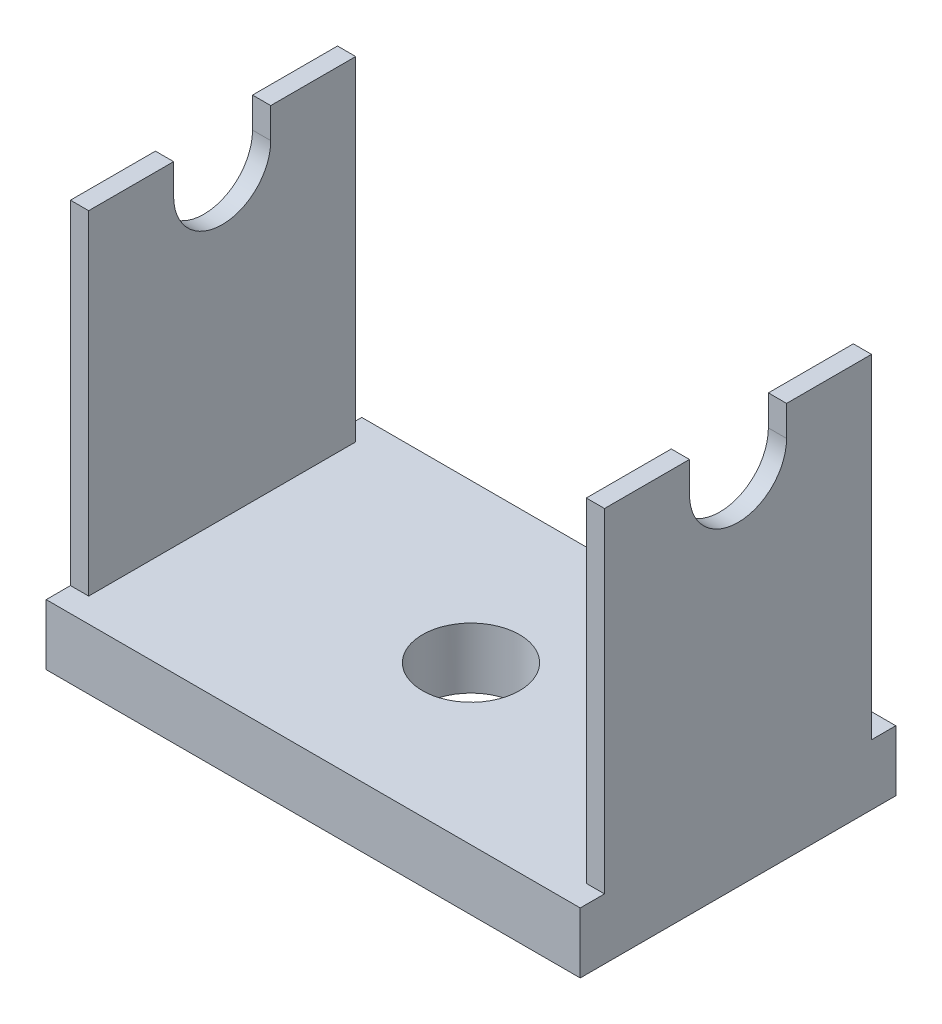
ISO-10303-21;
HEADER;
FILE_DESCRIPTION(('STEP AP214'),'2;1');
FILE_NAME('part.step','',(''),(''),'','','');
FILE_SCHEMA(('AUTOMOTIVE_DESIGN { 1 0 10303 214 1 1 1 1 }'));
ENDSEC;
DATA;
#1=APPLICATION_CONTEXT('core data for automotive mechanical design processes');
#2=APPLICATION_PROTOCOL_DEFINITION('international standard','automotive_design',2000,#1);
#3=PRODUCT_CONTEXT('',#1,'mechanical');
#4=PRODUCT('Part','Part','',(#3));
#5=PRODUCT_RELATED_PRODUCT_CATEGORY('part','',(#4));
#6=PRODUCT_DEFINITION_FORMATION('','',#4);
#7=PRODUCT_DEFINITION_CONTEXT('part definition',#1,'design');
#8=PRODUCT_DEFINITION('design','',#6,#7);
#9=PRODUCT_DEFINITION_SHAPE('','',#8);
#10=(LENGTH_UNIT() NAMED_UNIT(*) SI_UNIT(.MILLI.,.METRE.));
#11=(NAMED_UNIT(*) PLANE_ANGLE_UNIT() SI_UNIT($,.RADIAN.));
#12=(NAMED_UNIT(*) SI_UNIT($,.STERADIAN.) SOLID_ANGLE_UNIT());
#13=UNCERTAINTY_MEASURE_WITH_UNIT(LENGTH_MEASURE(1.E-05),#10,'distance_accuracy_value','');
#14=(GEOMETRIC_REPRESENTATION_CONTEXT(3) GLOBAL_UNCERTAINTY_ASSIGNED_CONTEXT((#13)) GLOBAL_UNIT_ASSIGNED_CONTEXT((#10,
#11,#12)) REPRESENTATION_CONTEXT('',''));
#15=CARTESIAN_POINT('',(0.,0.,0.));
#16=DIRECTION('',(0.,0.,1.));
#17=DIRECTION('',(1.,0.,0.));
#18=AXIS2_PLACEMENT_3D('',#15,#16,#17);
#19=CARTESIAN_POINT('',(-22.,2.5,-11.));
#20=DIRECTION('',(0.,0.,1.));
#21=DIRECTION('',(1.,0.,0.));
#22=AXIS2_PLACEMENT_3D('',#19,#20,#21);
#23=PLANE('',#22);
#24=DIRECTION('',(1.,0.,0.));
#25=VECTOR('',#24,1.);
#26=CARTESIAN_POINT('',(-22.,-25.,-11.));
#27=LINE('',#26,#25);
#28=CARTESIAN_POINT('',(-22.,-25.,-11.));
#29=VERTEX_POINT('',#28);
#30=CARTESIAN_POINT('',(-20.5,-25.,-11.));
#31=VERTEX_POINT('',#30);
#32=EDGE_CURVE('E215',#29,#31,#27,.T.);
#33=ORIENTED_EDGE('',*,*,#32,.F.);
#34=DIRECTION('',(0.,-1.,0.));
#35=VECTOR('',#34,1.);
#36=CARTESIAN_POINT('',(-22.,2.5,-11.));
#37=LINE('',#36,#35);
#38=CARTESIAN_POINT('',(-22.,2.5,-11.));
#39=VERTEX_POINT('',#38);
#40=EDGE_CURVE('E259',#39,#29,#37,.T.);
#41=ORIENTED_EDGE('',*,*,#40,.F.);
#42=DIRECTION('',(-1.,0.,0.));
#43=VECTOR('',#42,1.);
#44=CARTESIAN_POINT('',(-20.5,2.5,-11.));
#45=LINE('',#44,#43);
#46=CARTESIAN_POINT('',(-20.5,2.5,-11.));
#47=VERTEX_POINT('',#46);
#48=EDGE_CURVE('E256',#47,#39,#45,.T.);
#49=ORIENTED_EDGE('',*,*,#48,.F.);
#50=DIRECTION('',(0.,1.,0.));
#51=VECTOR('',#50,1.);
#52=CARTESIAN_POINT('',(-20.5,-28.5,-11.));
#53=LINE('',#52,#51);
#54=EDGE_CURVE('E270',#31,#47,#53,.T.);
#55=ORIENTED_EDGE('',*,*,#54,.F.);
#56=EDGE_LOOP('',(#33,#41,#49,#55));
#57=FACE_BOUND('',#56,.T.);
#58=ADVANCED_FACE('F33',(#57),#23,.F.);
#59=CARTESIAN_POINT('',(-22.,2.5,11.));
#60=DIRECTION('',(0.,0.,1.));
#61=DIRECTION('',(1.,0.,0.));
#62=AXIS2_PLACEMENT_3D('',#59,#60,#61);
#63=PLANE('',#62);
#64=DIRECTION('',(0.,-1.,0.));
#65=VECTOR('',#64,1.);
#66=CARTESIAN_POINT('',(-22.,2.5,11.));
#67=LINE('',#66,#65);
#68=CARTESIAN_POINT('',(-22.,2.5,11.));
#69=VERTEX_POINT('',#68);
#70=CARTESIAN_POINT('',(-22.,-25.,11.));
#71=VERTEX_POINT('',#70);
#72=EDGE_CURVE('E275',#69,#71,#67,.T.);
#73=ORIENTED_EDGE('',*,*,#72,.T.);
#74=DIRECTION('',(1.,0.,0.));
#75=VECTOR('',#74,1.);
#76=CARTESIAN_POINT('',(-22.,-25.,11.));
#77=LINE('',#76,#75);
#78=CARTESIAN_POINT('',(-20.5,-25.,11.));
#79=VERTEX_POINT('',#78);
#80=EDGE_CURVE('E58',#71,#79,#77,.T.);
#81=ORIENTED_EDGE('',*,*,#80,.T.);
#82=DIRECTION('',(0.,1.,0.));
#83=VECTOR('',#82,1.);
#84=CARTESIAN_POINT('',(-20.5,-28.5,11.));
#85=LINE('',#84,#83);
#86=CARTESIAN_POINT('',(-20.5,2.5,11.));
#87=VERTEX_POINT('',#86);
#88=EDGE_CURVE('E260',#79,#87,#85,.T.);
#89=ORIENTED_EDGE('',*,*,#88,.T.);
#90=DIRECTION('',(-1.,0.,0.));
#91=VECTOR('',#90,1.);
#92=CARTESIAN_POINT('',(-20.5,2.5,11.));
#93=LINE('',#92,#91);
#94=EDGE_CURVE('E255',#87,#69,#93,.T.);
#95=ORIENTED_EDGE('',*,*,#94,.T.);
#96=EDGE_LOOP('',(#73,#81,#89,#95));
#97=FACE_BOUND('',#96,.T.);
#98=ADVANCED_FACE('F402',(#97),#63,.T.);
#99=CARTESIAN_POINT('',(-20.5,-28.5,-11.));
#100=DIRECTION('',(1.,0.,0.));
#101=DIRECTION('',(0.,0.,-1.));
#102=AXIS2_PLACEMENT_3D('',#99,#100,#101);
#103=PLANE('',#102);
#104=ORIENTED_EDGE('',*,*,#88,.F.);
#105=DIRECTION('',(0.,0.,-1.));
#106=VECTOR('',#105,1.);
#107=CARTESIAN_POINT('',(-20.5,-25.,-11.));
#108=LINE('',#107,#106);
#109=EDGE_CURVE('E50',#79,#31,#108,.T.);
#110=ORIENTED_EDGE('',*,*,#109,.T.);
#111=ORIENTED_EDGE('',*,*,#54,.T.);
#112=DIRECTION('',(0.,0.,1.));
#113=VECTOR('',#112,1.);
#114=CARTESIAN_POINT('',(-20.5,2.5,-11.));
#115=LINE('',#114,#113);
#116=CARTESIAN_POINT('',(-20.5,2.5,-4.));
#117=VERTEX_POINT('',#116);
#118=EDGE_CURVE('E286',#47,#117,#115,.T.);
#119=ORIENTED_EDGE('',*,*,#118,.T.);
#120=DIRECTION('',(0.,1.,0.));
#121=VECTOR('',#120,1.);
#122=CARTESIAN_POINT('',(-20.5,-28.5,-4.));
#123=LINE('',#122,#121);
#124=CARTESIAN_POINT('',(-20.5,0.,-4.));
#125=VERTEX_POINT('',#124);
#126=EDGE_CURVE('E241',#125,#117,#123,.T.);
#127=ORIENTED_EDGE('',*,*,#126,.F.);
#128=CARTESIAN_POINT('',(-20.5,0.,0.));
#129=DIRECTION('',(1.,0.,0.));
#130=DIRECTION('',(0.,0.,-1.));
#131=AXIS2_PLACEMENT_3D('',#128,#129,#130);
#132=CIRCLE('',#131,4.);
#133=CARTESIAN_POINT('',(-20.5,0.,4.));
#134=VERTEX_POINT('',#133);
#135=EDGE_CURVE('E249',#134,#125,#132,.T.);
#136=ORIENTED_EDGE('',*,*,#135,.F.);
#137=DIRECTION('',(0.,-1.,0.));
#138=VECTOR('',#137,1.);
#139=CARTESIAN_POINT('',(-20.5,-28.5,4.));
#140=LINE('',#139,#138);
#141=CARTESIAN_POINT('',(-20.5,2.5,4.));
#142=VERTEX_POINT('',#141);
#143=EDGE_CURVE('E245',#142,#134,#140,.T.);
#144=ORIENTED_EDGE('',*,*,#143,.F.);
#145=EDGE_CURVE('E290',#142,#87,#115,.T.);
#146=ORIENTED_EDGE('',*,*,#145,.T.);
#147=EDGE_LOOP('',(#104,#110,#111,#119,#127,#136,#144,#146));
#148=FACE_BOUND('',#147,.T.);
#149=ADVANCED_FACE('F323',(#148),#103,.T.);
#150=CARTESIAN_POINT('',(20.5,2.50000000000001,-11.));
#151=DIRECTION('',(-1.,0.,0.));
#152=DIRECTION('',(0.,-1.,0.));
#153=AXIS2_PLACEMENT_3D('',#150,#151,#152);
#154=PLANE('',#153);
#155=DIRECTION('',(0.,-1.,0.));
#156=VECTOR('',#155,1.);
#157=CARTESIAN_POINT('',(20.5,2.50000000000001,-11.));
#158=LINE('',#157,#156);
#159=CARTESIAN_POINT('',(20.5,2.50000000000001,-11.));
#160=VERTEX_POINT('',#159);
#161=CARTESIAN_POINT('',(20.5,-25.,-11.));
#162=VERTEX_POINT('',#161);
#163=EDGE_CURVE('E267',#160,#162,#158,.T.);
#164=ORIENTED_EDGE('',*,*,#163,.T.);
#165=DIRECTION('',(0.,0.,1.));
#166=VECTOR('',#165,1.);
#167=CARTESIAN_POINT('',(20.5,-25.,-10.9999999999999));
#168=LINE('',#167,#166);
#169=CARTESIAN_POINT('',(20.5,-25.,11.));
#170=VERTEX_POINT('',#169);
#171=EDGE_CURVE('E208',#162,#170,#168,.T.);
#172=ORIENTED_EDGE('',*,*,#171,.T.);
#173=DIRECTION('',(0.,-1.,0.));
#174=VECTOR('',#173,1.);
#175=CARTESIAN_POINT('',(20.5,2.50000000000001,11.));
#176=LINE('',#175,#174);
#177=CARTESIAN_POINT('',(20.5,2.50000000000001,11.));
#178=VERTEX_POINT('',#177);
#179=EDGE_CURVE('E282',#178,#170,#176,.T.);
#180=ORIENTED_EDGE('',*,*,#179,.F.);
#181=DIRECTION('',(0.,0.,1.));
#182=VECTOR('',#181,1.);
#183=CARTESIAN_POINT('',(20.5,2.50000000000001,-11.));
#184=LINE('',#183,#182);
#185=CARTESIAN_POINT('',(20.5,2.50000000000001,4.));
#186=VERTEX_POINT('',#185);
#187=EDGE_CURVE('E294',#186,#178,#184,.T.);
#188=ORIENTED_EDGE('',*,*,#187,.F.);
#189=DIRECTION('',(0.,1.,0.));
#190=VECTOR('',#189,1.);
#191=CARTESIAN_POINT('',(20.5,2.50000000000001,4.));
#192=LINE('',#191,#190);
#193=CARTESIAN_POINT('',(20.5,0.,4.));
#194=VERTEX_POINT('',#193);
#195=EDGE_CURVE('E243',#194,#186,#192,.T.);
#196=ORIENTED_EDGE('',*,*,#195,.F.);
#197=CARTESIAN_POINT('',(20.5,0.,0.));
#198=DIRECTION('',(-1.,0.,0.));
#199=DIRECTION('',(0.,-1.,0.));
#200=AXIS2_PLACEMENT_3D('',#197,#198,#199);
#201=CIRCLE('',#200,4.);
#202=CARTESIAN_POINT('',(20.5,0.,-4.));
#203=VERTEX_POINT('',#202);
#204=EDGE_CURVE('E247',#203,#194,#201,.T.);
#205=ORIENTED_EDGE('',*,*,#204,.F.);
#206=DIRECTION('',(0.,-1.,0.));
#207=VECTOR('',#206,1.);
#208=CARTESIAN_POINT('',(20.5,2.50000000000001,-4.));
#209=LINE('',#208,#207);
#210=CARTESIAN_POINT('',(20.5,2.50000000000001,-4.));
#211=VERTEX_POINT('',#210);
#212=EDGE_CURVE('E239',#211,#203,#209,.T.);
#213=ORIENTED_EDGE('',*,*,#212,.F.);
#214=EDGE_CURVE('E291',#160,#211,#184,.T.);
#215=ORIENTED_EDGE('',*,*,#214,.F.);
#216=EDGE_LOOP('',(#164,#172,#180,#188,#196,#205,#213,#215));
#217=FACE_BOUND('',#216,.T.);
#218=ADVANCED_FACE('F366',(#217),#154,.T.);
#219=DIRECTION('',(1.,0.,0.));
#220=VECTOR('',#219,1.);
#221=CARTESIAN_POINT('',(-22.,-25.,-11.));
#222=LINE('',#221,#220);
#223=CARTESIAN_POINT('',(22.,-25.,-11.));
#224=VERTEX_POINT('',#223);
#225=EDGE_CURVE('E210',#162,#224,#222,.T.);
#226=ORIENTED_EDGE('',*,*,#225,.F.);
#227=ORIENTED_EDGE('',*,*,#163,.F.);
#228=DIRECTION('',(-1.,0.,0.));
#229=VECTOR('',#228,1.);
#230=CARTESIAN_POINT('',(22.,2.50000000000001,-11.));
#231=LINE('',#230,#229);
#232=CARTESIAN_POINT('',(22.,2.50000000000001,-11.));
#233=VERTEX_POINT('',#232);
#234=EDGE_CURVE('E264',#233,#160,#231,.T.);
#235=ORIENTED_EDGE('',*,*,#234,.F.);
#236=DIRECTION('',(0.,1.,0.));
#237=VECTOR('',#236,1.);
#238=CARTESIAN_POINT('',(22.,-30.,-11.));
#239=LINE('',#238,#237);
#240=EDGE_CURVE('E262',#224,#233,#239,.T.);
#241=ORIENTED_EDGE('',*,*,#240,.F.);
#242=EDGE_LOOP('',(#226,#227,#235,#241));
#243=FACE_BOUND('',#242,.T.);
#244=ADVANCED_FACE('F364',(#243),#23,.F.);
#245=ORIENTED_EDGE('',*,*,#179,.T.);
#246=DIRECTION('',(1.,0.,0.));
#247=VECTOR('',#246,1.);
#248=CARTESIAN_POINT('',(-22.,-25.,11.));
#249=LINE('',#248,#247);
#250=CARTESIAN_POINT('',(22.,-25.,11.));
#251=VERTEX_POINT('',#250);
#252=EDGE_CURVE('E206',#170,#251,#249,.T.);
#253=ORIENTED_EDGE('',*,*,#252,.T.);
#254=DIRECTION('',(0.,1.,0.));
#255=VECTOR('',#254,1.);
#256=CARTESIAN_POINT('',(22.,-30.,11.));
#257=LINE('',#256,#255);
#258=CARTESIAN_POINT('',(22.,2.50000000000001,11.));
#259=VERTEX_POINT('',#258);
#260=EDGE_CURVE('E277',#251,#259,#257,.T.);
#261=ORIENTED_EDGE('',*,*,#260,.T.);
#262=DIRECTION('',(-1.,0.,0.));
#263=VECTOR('',#262,1.);
#264=CARTESIAN_POINT('',(22.,2.50000000000001,11.));
#265=LINE('',#264,#263);
#266=EDGE_CURVE('E279',#259,#178,#265,.T.);
#267=ORIENTED_EDGE('',*,*,#266,.T.);
#268=EDGE_LOOP('',(#245,#253,#261,#267));
#269=FACE_BOUND('',#268,.T.);
#270=ADVANCED_FACE('F388',(#269),#63,.T.);
#271=CARTESIAN_POINT('',(-20.5,2.5,-11.));
#272=DIRECTION('',(0.,1.,0.));
#273=DIRECTION('',(0.,0.,1.));
#274=AXIS2_PLACEMENT_3D('',#271,#272,#273);
#275=PLANE('',#274);
#276=DIRECTION('',(1.,0.,0.));
#277=VECTOR('',#276,1.);
#278=CARTESIAN_POINT('',(-22.000025,2.5,4.));
#279=LINE('',#278,#277);
#280=CARTESIAN_POINT('',(-22.,2.5,4.));
#281=VERTEX_POINT('',#280);
#282=EDGE_CURVE('E229',#281,#142,#279,.T.);
#283=ORIENTED_EDGE('',*,*,#282,.F.);
#284=DIRECTION('',(0.,0.,1.));
#285=VECTOR('',#284,1.);
#286=CARTESIAN_POINT('',(-22.,2.5,-11.));
#287=LINE('',#286,#285);
#288=EDGE_CURVE('E272',#281,#69,#287,.T.);
#289=ORIENTED_EDGE('',*,*,#288,.T.);
#290=ORIENTED_EDGE('',*,*,#94,.F.);
#291=ORIENTED_EDGE('',*,*,#145,.F.);
#292=EDGE_LOOP('',(#283,#289,#290,#291));
#293=FACE_BOUND('',#292,.T.);
#294=ADVANCED_FACE('F320',(#293),#275,.T.);
#295=CARTESIAN_POINT('',(22.,2.50000000000001,-11.));
#296=DIRECTION('',(0.,1.,0.));
#297=DIRECTION('',(0.,0.,1.));
#298=AXIS2_PLACEMENT_3D('',#295,#296,#297);
#299=PLANE('',#298);
#300=CARTESIAN_POINT('',(22.,2.50000000000001,4.));
#301=VERTEX_POINT('',#300);
#302=EDGE_CURVE('E230',#186,#301,#279,.T.);
#303=ORIENTED_EDGE('',*,*,#302,.F.);
#304=ORIENTED_EDGE('',*,*,#187,.T.);
#305=ORIENTED_EDGE('',*,*,#266,.F.);
#306=DIRECTION('',(0.,0.,1.));
#307=VECTOR('',#306,1.);
#308=CARTESIAN_POINT('',(22.,2.50000000000001,-11.));
#309=LINE('',#308,#307);
#310=EDGE_CURVE('E298',#301,#259,#309,.T.);
#311=ORIENTED_EDGE('',*,*,#310,.F.);
#312=EDGE_LOOP('',(#303,#304,#305,#311));
#313=FACE_BOUND('',#312,.T.);
#314=ADVANCED_FACE('F385',(#313),#299,.T.);
#315=DIRECTION('',(1.,0.,0.));
#316=VECTOR('',#315,1.);
#317=CARTESIAN_POINT('',(-22.000025,2.5,-4.));
#318=LINE('',#317,#316);
#319=CARTESIAN_POINT('',(-22.,2.5,-4.));
#320=VERTEX_POINT('',#319);
#321=EDGE_CURVE('E232',#320,#117,#318,.T.);
#322=ORIENTED_EDGE('',*,*,#321,.T.);
#323=ORIENTED_EDGE('',*,*,#118,.F.);
#324=ORIENTED_EDGE('',*,*,#48,.T.);
#325=EDGE_CURVE('E183',#39,#320,#287,.T.);
#326=ORIENTED_EDGE('',*,*,#325,.T.);
#327=EDGE_LOOP('',(#322,#323,#324,#326));
#328=FACE_BOUND('',#327,.T.);
#329=ADVANCED_FACE('F35',(#328),#275,.T.);
#330=CARTESIAN_POINT('',(22.,2.50000000000001,-4.));
#331=VERTEX_POINT('',#330);
#332=EDGE_CURVE('E233',#211,#331,#318,.T.);
#333=ORIENTED_EDGE('',*,*,#332,.T.);
#334=EDGE_CURVE('E295',#233,#331,#309,.T.);
#335=ORIENTED_EDGE('',*,*,#334,.F.);
#336=ORIENTED_EDGE('',*,*,#234,.T.);
#337=ORIENTED_EDGE('',*,*,#214,.T.);
#338=EDGE_LOOP('',(#333,#335,#336,#337));
#339=FACE_BOUND('',#338,.T.);
#340=ADVANCED_FACE('F362',(#339),#299,.T.);
#341=CARTESIAN_POINT('',(22.,-30.,-11.));
#342=DIRECTION('',(1.,0.,0.));
#343=DIRECTION('',(0.,0.,-1.));
#344=AXIS2_PLACEMENT_3D('',#341,#342,#343);
#345=PLANE('',#344);
#346=DIRECTION('',(0.,0.,-1.));
#347=VECTOR('',#346,1.);
#348=CARTESIAN_POINT('',(22.,-25.,13.0000000000001));
#349=LINE('',#348,#347);
#350=CARTESIAN_POINT('',(22.,-25.,-13.));
#351=VERTEX_POINT('',#350);
#352=EDGE_CURVE('E343',#224,#351,#349,.T.);
#353=ORIENTED_EDGE('',*,*,#352,.F.);
#354=ORIENTED_EDGE('',*,*,#240,.T.);
#355=ORIENTED_EDGE('',*,*,#334,.T.);
#356=DIRECTION('',(0.,1.,0.));
#357=VECTOR('',#356,1.);
#358=CARTESIAN_POINT('',(22.,2.50000000000001,-4.));
#359=LINE('',#358,#357);
#360=CARTESIAN_POINT('',(22.,0.,-4.));
#361=VERTEX_POINT('',#360);
#362=EDGE_CURVE('E220',#361,#331,#359,.T.);
#363=ORIENTED_EDGE('',*,*,#362,.F.);
#364=CARTESIAN_POINT('',(22.,0.,0.));
#365=DIRECTION('',(1.,0.,0.));
#366=DIRECTION('',(0.,1.,0.));
#367=AXIS2_PLACEMENT_3D('',#364,#365,#366);
#368=CIRCLE('',#367,4.);
#369=CARTESIAN_POINT('',(22.,0.,4.));
#370=VERTEX_POINT('',#369);
#371=EDGE_CURVE('E218',#370,#361,#368,.T.);
#372=ORIENTED_EDGE('',*,*,#371,.F.);
#373=DIRECTION('',(0.,-1.,0.));
#374=VECTOR('',#373,1.);
#375=CARTESIAN_POINT('',(22.,0.,4.));
#376=LINE('',#375,#374);
#377=EDGE_CURVE('E222',#301,#370,#376,.T.);
#378=ORIENTED_EDGE('',*,*,#377,.F.);
#379=ORIENTED_EDGE('',*,*,#310,.T.);
#380=ORIENTED_EDGE('',*,*,#260,.F.);
#381=CARTESIAN_POINT('',(22.,-25.,13.));
#382=VERTEX_POINT('',#381);
#383=EDGE_CURVE('E339',#382,#251,#349,.T.);
#384=ORIENTED_EDGE('',*,*,#383,.F.);
#385=DIRECTION('',(0.,-1.,0.));
#386=VECTOR('',#385,1.);
#387=CARTESIAN_POINT('',(22.,26.1077293567225,13.));
#388=LINE('',#387,#386);
#389=CARTESIAN_POINT('',(22.,-30.,13.));
#390=VERTEX_POINT('',#389);
#391=EDGE_CURVE('E200',#382,#390,#388,.T.);
#392=ORIENTED_EDGE('',*,*,#391,.T.);
#393=DIRECTION('',(0.,0.,1.));
#394=VECTOR('',#393,1.);
#395=CARTESIAN_POINT('',(22.,-30.,-11.));
#396=LINE('',#395,#394);
#397=CARTESIAN_POINT('',(22.,-30.,-13.));
#398=VERTEX_POINT('',#397);
#399=EDGE_CURVE('E182',#398,#390,#396,.T.);
#400=ORIENTED_EDGE('',*,*,#399,.F.);
#401=DIRECTION('',(0.,-1.,0.));
#402=VECTOR('',#401,1.);
#403=CARTESIAN_POINT('',(22.,26.1077293567225,-13.));
#404=LINE('',#403,#402);
#405=EDGE_CURVE('E190',#351,#398,#404,.T.);
#406=ORIENTED_EDGE('',*,*,#405,.F.);
#407=EDGE_LOOP('',(#353,#354,#355,#363,#372,#378,#379,#380,#384,#392,#400,#406));
#408=FACE_BOUND('',#407,.T.);
#409=ADVANCED_FACE('F349',(#408),#345,.T.);
#410=CARTESIAN_POINT('',(-22.,-30.,-11.));
#411=DIRECTION('',(0.,-1.,0.));
#412=DIRECTION('',(1.,0.,0.));
#413=AXIS2_PLACEMENT_3D('',#410,#411,#412);
#414=PLANE('',#413);
#415=CARTESIAN_POINT('',(0.,-30.,0.));
#416=DIRECTION('',(0.,-1.,0.));
#417=DIRECTION('',(1.,0.,0.));
#418=AXIS2_PLACEMENT_3D('',#415,#416,#417);
#419=CIRCLE('',#418,4.);
#420=CARTESIAN_POINT('',(4.,-30.,0.));
#421=VERTEX_POINT('',#420);
#422=EDGE_CURVE('E198',#421,#421,#419,.T.);
#423=ORIENTED_EDGE('',*,*,#422,.F.);
#424=EDGE_LOOP('',(#423));
#425=FACE_BOUND('',#424,.T.);
#426=DIRECTION('',(-1.,0.,0.));
#427=VECTOR('',#426,1.);
#428=CARTESIAN_POINT('',(19.5,-30.,-13.));
#429=LINE('',#428,#427);
#430=CARTESIAN_POINT('',(-22.,-30.,-13.));
#431=VERTEX_POINT('',#430);
#432=EDGE_CURVE('E174',#398,#431,#429,.T.);
#433=ORIENTED_EDGE('',*,*,#432,.F.);
#434=ORIENTED_EDGE('',*,*,#399,.T.);
#435=DIRECTION('',(-1.,0.,0.));
#436=VECTOR('',#435,1.);
#437=CARTESIAN_POINT('',(19.5,-30.,13.));
#438=LINE('',#437,#436);
#439=CARTESIAN_POINT('',(-22.,-30.,13.));
#440=VERTEX_POINT('',#439);
#441=EDGE_CURVE('E177',#390,#440,#438,.T.);
#442=ORIENTED_EDGE('',*,*,#441,.T.);
#443=DIRECTION('',(0.,0.,1.));
#444=VECTOR('',#443,1.);
#445=CARTESIAN_POINT('',(-22.,-30.,-11.));
#446=LINE('',#445,#444);
#447=EDGE_CURVE('E171',#431,#440,#446,.T.);
#448=ORIENTED_EDGE('',*,*,#447,.F.);
#449=EDGE_LOOP('',(#433,#434,#442,#448));
#450=FACE_BOUND('',#449,.T.);
#451=ADVANCED_FACE('F173',(#425,#450),#414,.T.);
#452=CARTESIAN_POINT('',(-22.,2.5,-11.));
#453=DIRECTION('',(-1.,0.,0.));
#454=DIRECTION('',(0.,-1.,0.));
#455=AXIS2_PLACEMENT_3D('',#452,#453,#454);
#456=PLANE('',#455);
#457=ORIENTED_EDGE('',*,*,#447,.T.);
#458=DIRECTION('',(0.,-1.,0.));
#459=VECTOR('',#458,1.);
#460=CARTESIAN_POINT('',(-22.,26.1077293567225,13.));
#461=LINE('',#460,#459);
#462=CARTESIAN_POINT('',(-22.,-25.,13.));
#463=VERTEX_POINT('',#462);
#464=EDGE_CURVE('E342',#463,#440,#461,.T.);
#465=ORIENTED_EDGE('',*,*,#464,.F.);
#466=DIRECTION('',(0.,0.,1.));
#467=VECTOR('',#466,1.);
#468=CARTESIAN_POINT('',(-22.,-25.,13.0000000000001));
#469=LINE('',#468,#467);
#470=EDGE_CURVE('E336',#71,#463,#469,.T.);
#471=ORIENTED_EDGE('',*,*,#470,.F.);
#472=ORIENTED_EDGE('',*,*,#72,.F.);
#473=ORIENTED_EDGE('',*,*,#288,.F.);
#474=DIRECTION('',(0.,1.,0.));
#475=VECTOR('',#474,1.);
#476=CARTESIAN_POINT('',(-22.,2.5,4.));
#477=LINE('',#476,#475);
#478=CARTESIAN_POINT('',(-22.,0.,4.));
#479=VERTEX_POINT('',#478);
#480=EDGE_CURVE('E11',#479,#281,#477,.T.);
#481=ORIENTED_EDGE('',*,*,#480,.F.);
#482=CARTESIAN_POINT('',(-22.,0.,0.));
#483=DIRECTION('',(1.,0.,0.));
#484=DIRECTION('',(0.,1.,0.));
#485=AXIS2_PLACEMENT_3D('',#482,#483,#484);
#486=CIRCLE('',#485,4.);
#487=CARTESIAN_POINT('',(-22.,0.,-4.));
#488=VERTEX_POINT('',#487);
#489=EDGE_CURVE('E42',#488,#479,#486,.F.);
#490=ORIENTED_EDGE('',*,*,#489,.F.);
#491=DIRECTION('',(0.,-1.,0.));
#492=VECTOR('',#491,1.);
#493=CARTESIAN_POINT('',(-22.,2.5,-4.));
#494=LINE('',#493,#492);
#495=EDGE_CURVE('E289',#320,#488,#494,.T.);
#496=ORIENTED_EDGE('',*,*,#495,.F.);
#497=ORIENTED_EDGE('',*,*,#325,.F.);
#498=ORIENTED_EDGE('',*,*,#40,.T.);
#499=CARTESIAN_POINT('',(-22.,-25.0000000000001,-13.));
#500=VERTEX_POINT('',#499);
#501=EDGE_CURVE('E197',#500,#29,#469,.T.);
#502=ORIENTED_EDGE('',*,*,#501,.F.);
#503=DIRECTION('',(0.,-1.,0.));
#504=VECTOR('',#503,1.);
#505=CARTESIAN_POINT('',(-22.,26.1077293567225,-13.));
#506=LINE('',#505,#504);
#507=EDGE_CURVE('E188',#500,#431,#506,.T.);
#508=ORIENTED_EDGE('',*,*,#507,.T.);
#509=EDGE_LOOP('',(#457,#465,#471,#472,#473,#481,#490,#496,#497,#498,#502,#508));
#510=FACE_BOUND('',#509,.T.);
#511=ADVANCED_FACE('F194',(#510),#456,.T.);
#512=CARTESIAN_POINT('',(19.5,-25.,13.));
#513=DIRECTION('',(0.,-1.,0.));
#514=DIRECTION('',(0.,0.,-1.));
#515=AXIS2_PLACEMENT_3D('',#512,#513,#514);
#516=PLANE('',#515);
#517=CARTESIAN_POINT('',(0.,-25.,0.));
#518=DIRECTION('',(0.,-1.,0.));
#519=DIRECTION('',(0.,0.,-1.));
#520=AXIS2_PLACEMENT_3D('',#517,#518,#519);
#521=CIRCLE('',#520,4.);
#522=CARTESIAN_POINT('',(0.,-25.,-4.));
#523=VERTEX_POINT('',#522);
#524=EDGE_CURVE('E37',#523,#523,#521,.T.);
#525=ORIENTED_EDGE('',*,*,#524,.T.);
#526=EDGE_LOOP('',(#525));
#527=FACE_BOUND('',#526,.T.);
#528=DIRECTION('',(-1.,0.,0.));
#529=VECTOR('',#528,1.);
#530=CARTESIAN_POINT('',(19.5,-25.,13.));
#531=LINE('',#530,#529);
#532=EDGE_CURVE('E253',#382,#463,#531,.T.);
#533=ORIENTED_EDGE('',*,*,#532,.F.);
#534=ORIENTED_EDGE('',*,*,#383,.T.);
#535=ORIENTED_EDGE('',*,*,#252,.F.);
#536=ORIENTED_EDGE('',*,*,#171,.F.);
#537=ORIENTED_EDGE('',*,*,#225,.T.);
#538=ORIENTED_EDGE('',*,*,#352,.T.);
#539=DIRECTION('',(-1.,0.,0.));
#540=VECTOR('',#539,1.);
#541=CARTESIAN_POINT('',(19.5,-25.,-13.));
#542=LINE('',#541,#540);
#543=EDGE_CURVE('E191',#351,#500,#542,.T.);
#544=ORIENTED_EDGE('',*,*,#543,.T.);
#545=ORIENTED_EDGE('',*,*,#501,.T.);
#546=ORIENTED_EDGE('',*,*,#32,.T.);
#547=ORIENTED_EDGE('',*,*,#109,.F.);
#548=ORIENTED_EDGE('',*,*,#80,.F.);
#549=ORIENTED_EDGE('',*,*,#470,.T.);
#550=EDGE_LOOP('',(#533,#534,#535,#536,#537,#538,#544,#545,#546,#547,#548,#549));
#551=FACE_BOUND('',#550,.T.);
#552=ADVANCED_FACE('F334',(#527,#551),#516,.F.);
#553=CARTESIAN_POINT('',(19.5,-30.,13.));
#554=DIRECTION('',(0.,0.,-1.));
#555=DIRECTION('',(-1.,0.,0.));
#556=AXIS2_PLACEMENT_3D('',#553,#554,#555);
#557=PLANE('',#556);
#558=ORIENTED_EDGE('',*,*,#532,.T.);
#559=ORIENTED_EDGE('',*,*,#464,.T.);
#560=ORIENTED_EDGE('',*,*,#441,.F.);
#561=ORIENTED_EDGE('',*,*,#391,.F.);
#562=EDGE_LOOP('',(#558,#559,#560,#561));
#563=FACE_BOUND('',#562,.T.);
#564=ADVANCED_FACE('F353',(#563),#557,.F.);
#565=CARTESIAN_POINT('',(19.5,-30.,-13.));
#566=DIRECTION('',(0.,0.,-1.));
#567=DIRECTION('',(-1.,0.,0.));
#568=AXIS2_PLACEMENT_3D('',#565,#566,#567);
#569=PLANE('',#568);
#570=ORIENTED_EDGE('',*,*,#432,.T.);
#571=ORIENTED_EDGE('',*,*,#507,.F.);
#572=ORIENTED_EDGE('',*,*,#543,.F.);
#573=ORIENTED_EDGE('',*,*,#405,.T.);
#574=EDGE_LOOP('',(#570,#571,#572,#573));
#575=FACE_BOUND('',#574,.T.);
#576=ADVANCED_FACE('F187',(#575),#569,.T.);
#577=CARTESIAN_POINT('',(-22.000025,2.5,-4.));
#578=DIRECTION('',(0.,0.,-1.));
#579=DIRECTION('',(-1.,0.,0.));
#580=AXIS2_PLACEMENT_3D('',#577,#578,#579);
#581=PLANE('',#580);
#582=ORIENTED_EDGE('',*,*,#126,.T.);
#583=ORIENTED_EDGE('',*,*,#321,.F.);
#584=ORIENTED_EDGE('',*,*,#495,.T.);
#585=DIRECTION('',(1.,0.,0.));
#586=VECTOR('',#585,1.);
#587=CARTESIAN_POINT('',(-22.000025,0.,-4.));
#588=LINE('',#587,#586);
#589=EDGE_CURVE('E236',#488,#125,#588,.T.);
#590=ORIENTED_EDGE('',*,*,#589,.T.);
#591=EDGE_LOOP('',(#582,#583,#584,#590));
#592=FACE_BOUND('',#591,.T.);
#593=ADVANCED_FACE('F326',(#592),#581,.F.);
#594=CARTESIAN_POINT('',(-22.000025,0.,4.));
#595=DIRECTION('',(0.,0.,1.));
#596=DIRECTION('',(1.,0.,0.));
#597=AXIS2_PLACEMENT_3D('',#594,#595,#596);
#598=PLANE('',#597);
#599=ORIENTED_EDGE('',*,*,#143,.T.);
#600=DIRECTION('',(1.,0.,0.));
#601=VECTOR('',#600,1.);
#602=CARTESIAN_POINT('',(-22.000025,0.,4.));
#603=LINE('',#602,#601);
#604=EDGE_CURVE('E228',#479,#134,#603,.T.);
#605=ORIENTED_EDGE('',*,*,#604,.F.);
#606=ORIENTED_EDGE('',*,*,#480,.T.);
#607=ORIENTED_EDGE('',*,*,#282,.T.);
#608=EDGE_LOOP('',(#599,#605,#606,#607));
#609=FACE_BOUND('',#608,.T.);
#610=ADVANCED_FACE('F316',(#609),#598,.F.);
#611=CARTESIAN_POINT('',(-22.000025,0.,0.));
#612=DIRECTION('',(1.,0.,0.));
#613=DIRECTION('',(0.,1.,0.));
#614=AXIS2_PLACEMENT_3D('',#611,#612,#613);
#615=CYLINDRICAL_SURFACE('',#614,4.);
#616=ORIENTED_EDGE('',*,*,#135,.T.);
#617=ORIENTED_EDGE('',*,*,#589,.F.);
#618=ORIENTED_EDGE('',*,*,#489,.T.);
#619=ORIENTED_EDGE('',*,*,#604,.T.);
#620=EDGE_LOOP('',(#616,#617,#618,#619));
#621=FACE_BOUND('',#620,.T.);
#622=ADVANCED_FACE('F308',(#621),#615,.F.);
#623=ORIENTED_EDGE('',*,*,#204,.T.);
#624=EDGE_CURVE('E226',#194,#370,#603,.T.);
#625=ORIENTED_EDGE('',*,*,#624,.T.);
#626=ORIENTED_EDGE('',*,*,#371,.T.);
#627=EDGE_CURVE('E225',#203,#361,#588,.T.);
#628=ORIENTED_EDGE('',*,*,#627,.F.);
#629=EDGE_LOOP('',(#623,#625,#626,#628));
#630=FACE_BOUND('',#629,.T.);
#631=ADVANCED_FACE('F375',(#630),#615,.F.);
#632=ORIENTED_EDGE('',*,*,#195,.T.);
#633=ORIENTED_EDGE('',*,*,#302,.T.);
#634=ORIENTED_EDGE('',*,*,#377,.T.);
#635=ORIENTED_EDGE('',*,*,#624,.F.);
#636=EDGE_LOOP('',(#632,#633,#634,#635));
#637=FACE_BOUND('',#636,.T.);
#638=ADVANCED_FACE('F389',(#637),#598,.F.);
#639=ORIENTED_EDGE('',*,*,#212,.T.);
#640=ORIENTED_EDGE('',*,*,#627,.T.);
#641=ORIENTED_EDGE('',*,*,#362,.T.);
#642=ORIENTED_EDGE('',*,*,#332,.F.);
#643=EDGE_LOOP('',(#639,#640,#641,#642));
#644=FACE_BOUND('',#643,.T.);
#645=ADVANCED_FACE('F373',(#644),#581,.F.);
#646=CARTESIAN_POINT('',(0.,-33.5,0.));
#647=DIRECTION('',(0.,1.,0.));
#648=DIRECTION('',(0.,0.,1.));
#649=AXIS2_PLACEMENT_3D('',#646,#647,#648);
#650=CYLINDRICAL_SURFACE('',#649,4.);
#651=ORIENTED_EDGE('',*,*,#422,.T.);
#652=EDGE_LOOP('',(#651));
#653=FACE_BOUND('',#652,.T.);
#654=ORIENTED_EDGE('',*,*,#524,.F.);
#655=EDGE_LOOP('',(#654));
#656=FACE_BOUND('',#655,.T.);
#657=ADVANCED_FACE('F396',(#653,#656),#650,.F.);
#658=CLOSED_SHELL('',(#58,#98,#149,#218,#244,#270,#294,#314,#329,#340,#409,#451,#511,#552,#564,
#576,#593,#610,#622,#631,#638,#645,#657));
#659=MANIFOLD_SOLID_BREP('B2',#658);
#660=ADVANCED_BREP_SHAPE_REPRESENTATION('',(#18,#659),#14);
#661=SHAPE_DEFINITION_REPRESENTATION(#9,#660);
ENDSEC;
END-ISO-10303-21;
